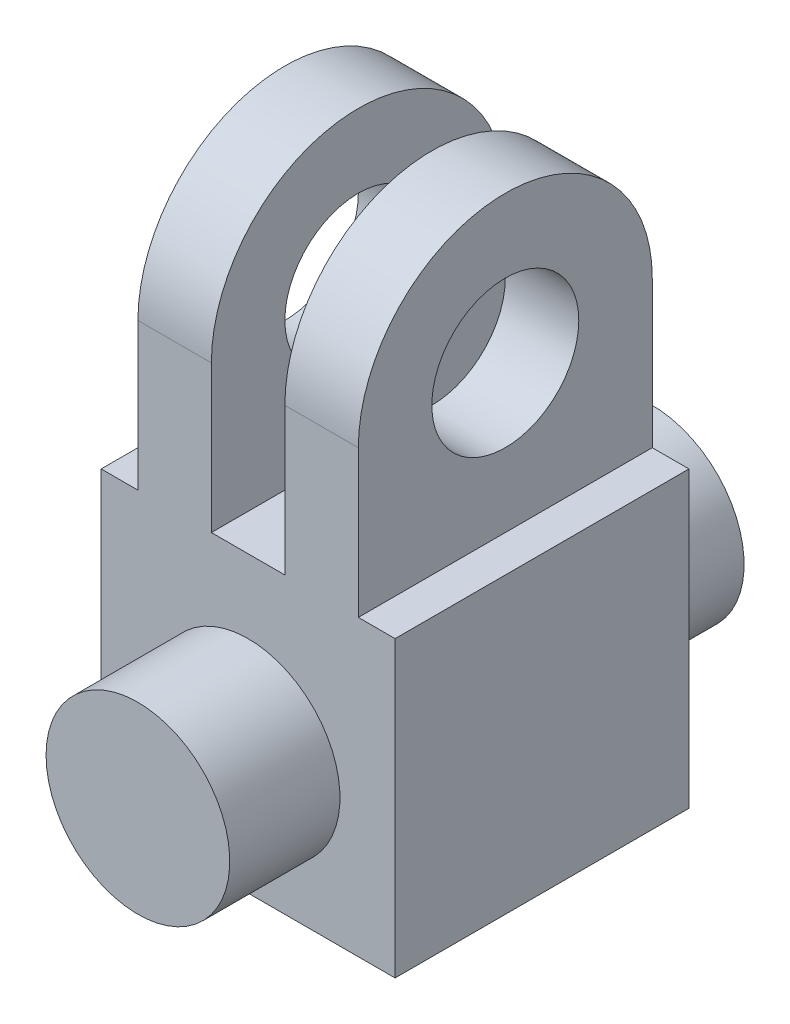
ISO-10303-21;
HEADER;
FILE_DESCRIPTION(('STEP AP214'),'2;1');
FILE_NAME('part.step','',(''),(''),'','','');
FILE_SCHEMA(('AUTOMOTIVE_DESIGN { 1 0 10303 214 1 1 1 1 }'));
ENDSEC;
DATA;
#1=APPLICATION_CONTEXT('core data for automotive mechanical design processes');
#2=APPLICATION_PROTOCOL_DEFINITION('international standard','automotive_design',2000,#1);
#3=PRODUCT_CONTEXT('',#1,'mechanical');
#4=PRODUCT('Part','Part','',(#3));
#5=PRODUCT_RELATED_PRODUCT_CATEGORY('part','',(#4));
#6=PRODUCT_DEFINITION_FORMATION('','',#4);
#7=PRODUCT_DEFINITION_CONTEXT('part definition',#1,'design');
#8=PRODUCT_DEFINITION('design','',#6,#7);
#9=PRODUCT_DEFINITION_SHAPE('','',#8);
#10=(LENGTH_UNIT() NAMED_UNIT(*) SI_UNIT(.MILLI.,.METRE.));
#11=(NAMED_UNIT(*) PLANE_ANGLE_UNIT() SI_UNIT($,.RADIAN.));
#12=(NAMED_UNIT(*) SI_UNIT($,.STERADIAN.) SOLID_ANGLE_UNIT());
#13=UNCERTAINTY_MEASURE_WITH_UNIT(LENGTH_MEASURE(1.E-05),#10,'distance_accuracy_value','');
#14=(GEOMETRIC_REPRESENTATION_CONTEXT(3) GLOBAL_UNCERTAINTY_ASSIGNED_CONTEXT((#13)) GLOBAL_UNIT_ASSIGNED_CONTEXT((#10,
#11,#12)) REPRESENTATION_CONTEXT('',''));
#15=CARTESIAN_POINT('',(0.,0.,0.));
#16=DIRECTION('',(0.,0.,1.));
#17=DIRECTION('',(1.,0.,0.));
#18=AXIS2_PLACEMENT_3D('',#15,#16,#17);
#19=CARTESIAN_POINT('',(70.,80.,0.));
#20=DIRECTION('',(-1.,0.,0.));
#21=DIRECTION('',(0.,0.,1.));
#22=AXIS2_PLACEMENT_3D('',#19,#20,#21);
#23=PLANE('',#22);
#24=CARTESIAN_POINT('',(70.,120.,40.));
#25=DIRECTION('',(1.,0.,0.));
#26=DIRECTION('',(0.,0.,-1.));
#27=AXIS2_PLACEMENT_3D('',#24,#25,#26);
#28=CIRCLE('',#27,20.);
#29=CARTESIAN_POINT('',(70.,120.,20.));
#30=VERTEX_POINT('',#29);
#31=EDGE_CURVE('E223',#30,#30,#28,.T.);
#32=ORIENTED_EDGE('',*,*,#31,.F.);
#33=EDGE_LOOP('',(#32));
#34=FACE_BOUND('',#33,.T.);
#35=DIRECTION('',(0.,1.,0.));
#36=VECTOR('',#35,1.);
#37=CARTESIAN_POINT('',(70.,80.,0.));
#38=LINE('',#37,#36);
#39=CARTESIAN_POINT('',(70.,80.,0.));
#40=VERTEX_POINT('',#39);
#41=CARTESIAN_POINT('',(70.,120.,0.));
#42=VERTEX_POINT('',#41);
#43=EDGE_CURVE('E174',#40,#42,#38,.T.);
#44=ORIENTED_EDGE('',*,*,#43,.T.);
#45=CARTESIAN_POINT('',(70.,120.,40.));
#46=DIRECTION('',(1.,0.,0.));
#47=DIRECTION('',(0.,0.,-1.));
#48=AXIS2_PLACEMENT_3D('',#45,#46,#47);
#49=CIRCLE('',#48,40.);
#50=CARTESIAN_POINT('',(70.,120.,80.));
#51=VERTEX_POINT('',#50);
#52=EDGE_CURVE('E157',#42,#51,#49,.T.);
#53=ORIENTED_EDGE('',*,*,#52,.T.);
#54=DIRECTION('',(0.,1.,0.));
#55=VECTOR('',#54,1.);
#56=CARTESIAN_POINT('',(70.,80.,80.));
#57=LINE('',#56,#55);
#58=CARTESIAN_POINT('',(70.,80.,80.));
#59=VERTEX_POINT('',#58);
#60=EDGE_CURVE('E183',#59,#51,#57,.T.);
#61=ORIENTED_EDGE('',*,*,#60,.F.);
#62=DIRECTION('',(0.,0.,1.));
#63=VECTOR('',#62,1.);
#64=CARTESIAN_POINT('',(70.,80.,0.));
#65=LINE('',#64,#63);
#66=EDGE_CURVE('E180',#40,#59,#65,.T.);
#67=ORIENTED_EDGE('',*,*,#66,.F.);
#68=EDGE_LOOP('',(#44,#53,#61,#67));
#69=FACE_BOUND('',#68,.T.);
#70=ADVANCED_FACE('F63',(#34,#69),#23,.F.);
#71=CARTESIAN_POINT('',(10.,80.,0.));
#72=DIRECTION('',(1.,0.,0.));
#73=DIRECTION('',(0.,0.,-1.));
#74=AXIS2_PLACEMENT_3D('',#71,#72,#73);
#75=PLANE('',#74);
#76=CARTESIAN_POINT('',(10.,120.,40.));
#77=DIRECTION('',(1.,0.,0.));
#78=DIRECTION('',(0.,0.,-1.));
#79=AXIS2_PLACEMENT_3D('',#76,#77,#78);
#80=CIRCLE('',#79,20.);
#81=CARTESIAN_POINT('',(10.,120.,20.));
#82=VERTEX_POINT('',#81);
#83=EDGE_CURVE('E167',#82,#82,#80,.T.);
#84=ORIENTED_EDGE('',*,*,#83,.T.);
#85=EDGE_LOOP('',(#84));
#86=FACE_BOUND('',#85,.T.);
#87=CARTESIAN_POINT('',(10.,120.,40.));
#88=DIRECTION('',(1.,0.,0.));
#89=DIRECTION('',(0.,0.,-1.));
#90=AXIS2_PLACEMENT_3D('',#87,#88,#89);
#91=CIRCLE('',#90,40.);
#92=CARTESIAN_POINT('',(10.,120.,0.));
#93=VERTEX_POINT('',#92);
#94=CARTESIAN_POINT('',(10.,120.,80.));
#95=VERTEX_POINT('',#94);
#96=EDGE_CURVE('E248',#93,#95,#91,.T.);
#97=ORIENTED_EDGE('',*,*,#96,.F.);
#98=DIRECTION('',(0.,1.,0.));
#99=VECTOR('',#98,1.);
#100=CARTESIAN_POINT('',(10.,80.,0.));
#101=LINE('',#100,#99);
#102=CARTESIAN_POINT('',(10.,80.,0.));
#103=VERTEX_POINT('',#102);
#104=EDGE_CURVE('E196',#103,#93,#101,.T.);
#105=ORIENTED_EDGE('',*,*,#104,.F.);
#106=DIRECTION('',(0.,0.,-1.));
#107=VECTOR('',#106,1.);
#108=CARTESIAN_POINT('',(10.,80.,0.));
#109=LINE('',#108,#107);
#110=CARTESIAN_POINT('',(10.,80.,80.));
#111=VERTEX_POINT('',#110);
#112=EDGE_CURVE('E288',#111,#103,#109,.T.);
#113=ORIENTED_EDGE('',*,*,#112,.F.);
#114=DIRECTION('',(0.,1.,0.));
#115=VECTOR('',#114,1.);
#116=CARTESIAN_POINT('',(10.,80.,80.));
#117=LINE('',#116,#115);
#118=EDGE_CURVE('E295',#111,#95,#117,.T.);
#119=ORIENTED_EDGE('',*,*,#118,.T.);
#120=EDGE_LOOP('',(#97,#105,#113,#119));
#121=FACE_BOUND('',#120,.T.);
#122=ADVANCED_FACE('F332',(#86,#121),#75,.F.);
#123=CARTESIAN_POINT('',(30.,80.,0.));
#124=DIRECTION('',(-1.,0.,0.));
#125=DIRECTION('',(0.,0.,1.));
#126=AXIS2_PLACEMENT_3D('',#123,#124,#125);
#127=PLANE('',#126);
#128=CARTESIAN_POINT('',(30.,120.,40.));
#129=DIRECTION('',(-1.,0.,0.));
#130=DIRECTION('',(0.,0.,1.));
#131=AXIS2_PLACEMENT_3D('',#128,#129,#130);
#132=CIRCLE('',#131,20.);
#133=CARTESIAN_POINT('',(30.,120.,60.));
#134=VERTEX_POINT('',#133);
#135=EDGE_CURVE('E222',#134,#134,#132,.T.);
#136=ORIENTED_EDGE('',*,*,#135,.T.);
#137=EDGE_LOOP('',(#136));
#138=FACE_BOUND('',#137,.T.);
#139=DIRECTION('',(0.,1.,0.));
#140=VECTOR('',#139,1.);
#141=CARTESIAN_POINT('',(30.,80.,0.));
#142=LINE('',#141,#140);
#143=CARTESIAN_POINT('',(30.,80.,0.));
#144=VERTEX_POINT('',#143);
#145=CARTESIAN_POINT('',(30.,120.,0.));
#146=VERTEX_POINT('',#145);
#147=EDGE_CURVE('E268',#144,#146,#142,.T.);
#148=ORIENTED_EDGE('',*,*,#147,.T.);
#149=CARTESIAN_POINT('',(30.,120.,40.));
#150=DIRECTION('',(-1.,0.,0.));
#151=DIRECTION('',(0.,0.,1.));
#152=AXIS2_PLACEMENT_3D('',#149,#150,#151);
#153=CIRCLE('',#152,40.);
#154=CARTESIAN_POINT('',(30.,120.,80.));
#155=VERTEX_POINT('',#154);
#156=EDGE_CURVE('E245',#155,#146,#153,.T.);
#157=ORIENTED_EDGE('',*,*,#156,.F.);
#158=DIRECTION('',(0.,1.,0.));
#159=VECTOR('',#158,1.);
#160=CARTESIAN_POINT('',(30.,80.,80.));
#161=LINE('',#160,#159);
#162=CARTESIAN_POINT('',(30.,80.,80.));
#163=VERTEX_POINT('',#162);
#164=EDGE_CURVE('E267',#163,#155,#161,.T.);
#165=ORIENTED_EDGE('',*,*,#164,.F.);
#166=DIRECTION('',(0.,0.,1.));
#167=VECTOR('',#166,1.);
#168=CARTESIAN_POINT('',(30.,80.,0.));
#169=LINE('',#168,#167);
#170=EDGE_CURVE('E251',#144,#163,#169,.T.);
#171=ORIENTED_EDGE('',*,*,#170,.F.);
#172=EDGE_LOOP('',(#148,#157,#165,#171));
#173=FACE_BOUND('',#172,.T.);
#174=ADVANCED_FACE('F335',(#138,#173),#127,.F.);
#175=CARTESIAN_POINT('',(50.,80.,0.));
#176=DIRECTION('',(1.,0.,0.));
#177=DIRECTION('',(0.,0.,-1.));
#178=AXIS2_PLACEMENT_3D('',#175,#176,#177);
#179=PLANE('',#178);
#180=CARTESIAN_POINT('',(50.,120.,40.));
#181=DIRECTION('',(1.,0.,0.));
#182=DIRECTION('',(0.,0.,-1.));
#183=AXIS2_PLACEMENT_3D('',#180,#181,#182);
#184=CIRCLE('',#183,20.);
#185=CARTESIAN_POINT('',(50.,120.,20.));
#186=VERTEX_POINT('',#185);
#187=EDGE_CURVE('E219',#186,#186,#184,.T.);
#188=ORIENTED_EDGE('',*,*,#187,.T.);
#189=EDGE_LOOP('',(#188));
#190=FACE_BOUND('',#189,.T.);
#191=CARTESIAN_POINT('',(50.,120.,40.));
#192=DIRECTION('',(1.,0.,0.));
#193=DIRECTION('',(0.,0.,-1.));
#194=AXIS2_PLACEMENT_3D('',#191,#192,#193);
#195=CIRCLE('',#194,40.);
#196=CARTESIAN_POINT('',(50.,120.,0.));
#197=VERTEX_POINT('',#196);
#198=CARTESIAN_POINT('',(50.,120.,80.));
#199=VERTEX_POINT('',#198);
#200=EDGE_CURVE('E178',#197,#199,#195,.T.);
#201=ORIENTED_EDGE('',*,*,#200,.F.);
#202=DIRECTION('',(0.,1.,0.));
#203=VECTOR('',#202,1.);
#204=CARTESIAN_POINT('',(50.,80.,0.));
#205=LINE('',#204,#203);
#206=CARTESIAN_POINT('',(50.,80.,0.));
#207=VERTEX_POINT('',#206);
#208=EDGE_CURVE('E176',#207,#197,#205,.T.);
#209=ORIENTED_EDGE('',*,*,#208,.F.);
#210=DIRECTION('',(0.,0.,-1.));
#211=VECTOR('',#210,1.);
#212=CARTESIAN_POINT('',(50.,80.,0.));
#213=LINE('',#212,#211);
#214=CARTESIAN_POINT('',(50.,80.,80.));
#215=VERTEX_POINT('',#214);
#216=EDGE_CURVE('E259',#215,#207,#213,.T.);
#217=ORIENTED_EDGE('',*,*,#216,.F.);
#218=DIRECTION('',(0.,1.,0.));
#219=VECTOR('',#218,1.);
#220=CARTESIAN_POINT('',(50.,80.,80.));
#221=LINE('',#220,#219);
#222=EDGE_CURVE('E275',#215,#199,#221,.T.);
#223=ORIENTED_EDGE('',*,*,#222,.T.);
#224=EDGE_LOOP('',(#201,#209,#217,#223));
#225=FACE_BOUND('',#224,.T.);
#226=ADVANCED_FACE('F341',(#190,#225),#179,.F.);
#227=CARTESIAN_POINT('',(0.,160.,80.));
#228=DIRECTION('',(0.,0.,-1.));
#229=DIRECTION('',(-1.,0.,0.));
#230=AXIS2_PLACEMENT_3D('',#227,#228,#229);
#231=PLANE('',#230);
#232=CARTESIAN_POINT('',(40.,35.,80.));
#233=DIRECTION('',(0.,0.,-1.));
#234=DIRECTION('',(-1.,0.,0.));
#235=AXIS2_PLACEMENT_3D('',#232,#233,#234);
#236=CIRCLE('',#235,25.);
#237=CARTESIAN_POINT('',(15.,35.,80.));
#238=VERTEX_POINT('',#237);
#239=EDGE_CURVE('E231',#238,#238,#236,.T.);
#240=ORIENTED_EDGE('',*,*,#239,.T.);
#241=EDGE_LOOP('',(#240));
#242=FACE_BOUND('',#241,.T.);
#243=DIRECTION('',(1.,0.,0.));
#244=VECTOR('',#243,1.);
#245=CARTESIAN_POINT('',(-9.99999999999997,120.,80.));
#246=LINE('',#245,#244);
#247=EDGE_CURVE('E81',#95,#155,#246,.T.);
#248=ORIENTED_EDGE('',*,*,#247,.F.);
#249=ORIENTED_EDGE('',*,*,#118,.F.);
#250=DIRECTION('',(1.,0.,0.));
#251=VECTOR('',#250,1.);
#252=CARTESIAN_POINT('',(0.,80.,80.));
#253=LINE('',#252,#251);
#254=CARTESIAN_POINT('',(0.,80.,80.));
#255=VERTEX_POINT('',#254);
#256=EDGE_CURVE('E284',#255,#111,#253,.T.);
#257=ORIENTED_EDGE('',*,*,#256,.F.);
#258=DIRECTION('',(0.,-1.,0.));
#259=VECTOR('',#258,1.);
#260=CARTESIAN_POINT('',(0.,160.,80.));
#261=LINE('',#260,#259);
#262=CARTESIAN_POINT('',(0.,0.,80.));
#263=VERTEX_POINT('',#262);
#264=EDGE_CURVE('E215',#255,#263,#261,.T.);
#265=ORIENTED_EDGE('',*,*,#264,.T.);
#266=DIRECTION('',(1.,0.,0.));
#267=VECTOR('',#266,1.);
#268=CARTESIAN_POINT('',(0.,0.,80.));
#269=LINE('',#268,#267);
#270=CARTESIAN_POINT('',(80.,0.,80.));
#271=VERTEX_POINT('',#270);
#272=EDGE_CURVE('E195',#263,#271,#269,.T.);
#273=ORIENTED_EDGE('',*,*,#272,.T.);
#274=DIRECTION('',(0.,-1.,0.));
#275=VECTOR('',#274,1.);
#276=CARTESIAN_POINT('',(80.,160.,80.));
#277=LINE('',#276,#275);
#278=CARTESIAN_POINT('',(80.,80.,80.));
#279=VERTEX_POINT('',#278);
#280=EDGE_CURVE('E212',#279,#271,#277,.T.);
#281=ORIENTED_EDGE('',*,*,#280,.F.);
#282=DIRECTION('',(1.,0.,0.));
#283=VECTOR('',#282,1.);
#284=CARTESIAN_POINT('',(80.,80.,80.));
#285=LINE('',#284,#283);
#286=EDGE_CURVE('E184',#59,#279,#285,.T.);
#287=ORIENTED_EDGE('',*,*,#286,.F.);
#288=ORIENTED_EDGE('',*,*,#60,.T.);
#289=EDGE_CURVE('E162',#199,#51,#246,.T.);
#290=ORIENTED_EDGE('',*,*,#289,.F.);
#291=ORIENTED_EDGE('',*,*,#222,.F.);
#292=DIRECTION('',(1.,0.,0.));
#293=VECTOR('',#292,1.);
#294=CARTESIAN_POINT('',(30.,80.,80.));
#295=LINE('',#294,#293);
#296=EDGE_CURVE('E255',#163,#215,#295,.T.);
#297=ORIENTED_EDGE('',*,*,#296,.F.);
#298=ORIENTED_EDGE('',*,*,#164,.T.);
#299=EDGE_LOOP('',(#248,#249,#257,#265,#273,#281,#287,#288,#290,#291,#297,#298));
#300=FACE_BOUND('',#299,.T.);
#301=ADVANCED_FACE('F313',(#242,#300),#231,.F.);
#302=CARTESIAN_POINT('',(0.,160.,0.));
#303=DIRECTION('',(1.,0.,0.));
#304=DIRECTION('',(0.,0.,-1.));
#305=AXIS2_PLACEMENT_3D('',#302,#303,#304);
#306=PLANE('',#305);
#307=DIRECTION('',(0.,0.,1.));
#308=VECTOR('',#307,1.);
#309=CARTESIAN_POINT('',(0.,80.,0.));
#310=LINE('',#309,#308);
#311=CARTESIAN_POINT('',(0.,80.,0.));
#312=VERTEX_POINT('',#311);
#313=EDGE_CURVE('E188',#312,#255,#310,.T.);
#314=ORIENTED_EDGE('',*,*,#313,.F.);
#315=DIRECTION('',(0.,-1.,0.));
#316=VECTOR('',#315,1.);
#317=CARTESIAN_POINT('',(0.,160.,0.));
#318=LINE('',#317,#316);
#319=CARTESIAN_POINT('',(0.,0.,0.));
#320=VERTEX_POINT('',#319);
#321=EDGE_CURVE('E89',#312,#320,#318,.T.);
#322=ORIENTED_EDGE('',*,*,#321,.T.);
#323=DIRECTION('',(0.,0.,1.));
#324=VECTOR('',#323,1.);
#325=CARTESIAN_POINT('',(0.,0.,0.));
#326=LINE('',#325,#324);
#327=EDGE_CURVE('E192',#320,#263,#326,.T.);
#328=ORIENTED_EDGE('',*,*,#327,.T.);
#329=ORIENTED_EDGE('',*,*,#264,.F.);
#330=EDGE_LOOP('',(#314,#322,#328,#329));
#331=FACE_BOUND('',#330,.T.);
#332=ADVANCED_FACE('F65',(#331),#306,.F.);
#333=CARTESIAN_POINT('',(80.,160.,0.));
#334=DIRECTION('',(-1.,0.,0.));
#335=DIRECTION('',(0.,0.,1.));
#336=AXIS2_PLACEMENT_3D('',#333,#334,#335);
#337=PLANE('',#336);
#338=DIRECTION('',(0.,-1.,0.));
#339=VECTOR('',#338,1.);
#340=CARTESIAN_POINT('',(80.,160.,0.));
#341=LINE('',#340,#339);
#342=CARTESIAN_POINT('',(80.,80.,0.));
#343=VERTEX_POINT('',#342);
#344=CARTESIAN_POINT('',(80.,0.,0.));
#345=VERTEX_POINT('',#344);
#346=EDGE_CURVE('E209',#343,#345,#341,.T.);
#347=ORIENTED_EDGE('',*,*,#346,.F.);
#348=DIRECTION('',(0.,0.,-1.));
#349=VECTOR('',#348,1.);
#350=CARTESIAN_POINT('',(80.,80.,0.));
#351=LINE('',#350,#349);
#352=EDGE_CURVE('E272',#279,#343,#351,.T.);
#353=ORIENTED_EDGE('',*,*,#352,.F.);
#354=ORIENTED_EDGE('',*,*,#280,.T.);
#355=DIRECTION('',(0.,0.,-1.));
#356=VECTOR('',#355,1.);
#357=CARTESIAN_POINT('',(80.,0.,0.));
#358=LINE('',#357,#356);
#359=EDGE_CURVE('E200',#271,#345,#358,.T.);
#360=ORIENTED_EDGE('',*,*,#359,.T.);
#361=EDGE_LOOP('',(#347,#353,#354,#360));
#362=FACE_BOUND('',#361,.T.);
#363=ADVANCED_FACE('F318',(#362),#337,.F.);
#364=CARTESIAN_POINT('',(0.,160.,0.));
#365=DIRECTION('',(0.,0.,1.));
#366=DIRECTION('',(1.,0.,0.));
#367=AXIS2_PLACEMENT_3D('',#364,#365,#366);
#368=PLANE('',#367);
#369=CARTESIAN_POINT('',(40.,35.,0.));
#370=DIRECTION('',(0.,0.,1.));
#371=DIRECTION('',(1.,0.,0.));
#372=AXIS2_PLACEMENT_3D('',#369,#370,#371);
#373=CIRCLE('',#372,25.);
#374=CARTESIAN_POINT('',(65.,35.,0.));
#375=VERTEX_POINT('',#374);
#376=EDGE_CURVE('E67',#375,#375,#373,.T.);
#377=ORIENTED_EDGE('',*,*,#376,.T.);
#378=EDGE_LOOP('',(#377));
#379=FACE_BOUND('',#378,.T.);
#380=ORIENTED_EDGE('',*,*,#104,.T.);
#381=DIRECTION('',(1.,0.,0.));
#382=VECTOR('',#381,1.);
#383=CARTESIAN_POINT('',(-9.99999999999998,120.,0.));
#384=LINE('',#383,#382);
#385=EDGE_CURVE('E12',#93,#146,#384,.T.);
#386=ORIENTED_EDGE('',*,*,#385,.T.);
#387=ORIENTED_EDGE('',*,*,#147,.F.);
#388=DIRECTION('',(-1.,0.,0.));
#389=VECTOR('',#388,1.);
#390=CARTESIAN_POINT('',(30.,80.,0.));
#391=LINE('',#390,#389);
#392=EDGE_CURVE('E263',#207,#144,#391,.T.);
#393=ORIENTED_EDGE('',*,*,#392,.F.);
#394=ORIENTED_EDGE('',*,*,#208,.T.);
#395=EDGE_CURVE('E73',#197,#42,#384,.T.);
#396=ORIENTED_EDGE('',*,*,#395,.T.);
#397=ORIENTED_EDGE('',*,*,#43,.F.);
#398=DIRECTION('',(-1.,0.,0.));
#399=VECTOR('',#398,1.);
#400=CARTESIAN_POINT('',(80.,80.,0.));
#401=LINE('',#400,#399);
#402=EDGE_CURVE('E303',#343,#40,#401,.T.);
#403=ORIENTED_EDGE('',*,*,#402,.F.);
#404=ORIENTED_EDGE('',*,*,#346,.T.);
#405=DIRECTION('',(-1.,0.,0.));
#406=VECTOR('',#405,1.);
#407=CARTESIAN_POINT('',(0.,0.,0.));
#408=LINE('',#407,#406);
#409=EDGE_CURVE('E204',#345,#320,#408,.T.);
#410=ORIENTED_EDGE('',*,*,#409,.T.);
#411=ORIENTED_EDGE('',*,*,#321,.F.);
#412=DIRECTION('',(-1.,0.,0.));
#413=VECTOR('',#412,1.);
#414=CARTESIAN_POINT('',(0.,80.,0.));
#415=LINE('',#414,#413);
#416=EDGE_CURVE('E292',#103,#312,#415,.T.);
#417=ORIENTED_EDGE('',*,*,#416,.F.);
#418=EDGE_LOOP('',(#380,#386,#387,#393,#394,#396,#397,#403,#404,#410,#411,#417));
#419=FACE_BOUND('',#418,.T.);
#420=ADVANCED_FACE('F172',(#379,#419),#368,.F.);
#421=CARTESIAN_POINT('',(0.,0.,0.));
#422=DIRECTION('',(0.,1.,0.));
#423=DIRECTION('',(0.,0.,1.));
#424=AXIS2_PLACEMENT_3D('',#421,#422,#423);
#425=PLANE('',#424);
#426=ORIENTED_EDGE('',*,*,#327,.F.);
#427=ORIENTED_EDGE('',*,*,#409,.F.);
#428=ORIENTED_EDGE('',*,*,#359,.F.);
#429=ORIENTED_EDGE('',*,*,#272,.F.);
#430=EDGE_LOOP('',(#426,#427,#428,#429));
#431=FACE_BOUND('',#430,.T.);
#432=ADVANCED_FACE('F323',(#431),#425,.F.);
#433=CARTESIAN_POINT('',(0.,80.,0.));
#434=DIRECTION('',(0.,-1.,0.));
#435=DIRECTION('',(0.,0.,-1.));
#436=AXIS2_PLACEMENT_3D('',#433,#434,#435);
#437=PLANE('',#436);
#438=ORIENTED_EDGE('',*,*,#352,.T.);
#439=ORIENTED_EDGE('',*,*,#402,.T.);
#440=ORIENTED_EDGE('',*,*,#66,.T.);
#441=ORIENTED_EDGE('',*,*,#286,.T.);
#442=EDGE_LOOP('',(#438,#439,#440,#441));
#443=FACE_BOUND('',#442,.T.);
#444=ADVANCED_FACE('F309',(#443),#437,.F.);
#445=CARTESIAN_POINT('',(0.,80.,0.));
#446=DIRECTION('',(0.,1.,0.));
#447=DIRECTION('',(0.,0.,1.));
#448=AXIS2_PLACEMENT_3D('',#445,#446,#447);
#449=PLANE('',#448);
#450=ORIENTED_EDGE('',*,*,#313,.T.);
#451=ORIENTED_EDGE('',*,*,#256,.T.);
#452=ORIENTED_EDGE('',*,*,#112,.T.);
#453=ORIENTED_EDGE('',*,*,#416,.T.);
#454=EDGE_LOOP('',(#450,#451,#452,#453));
#455=FACE_BOUND('',#454,.T.);
#456=ADVANCED_FACE('F328',(#455),#449,.T.);
#457=CARTESIAN_POINT('',(0.,80.,0.));
#458=DIRECTION('',(0.,1.,0.));
#459=DIRECTION('',(0.,0.,1.));
#460=AXIS2_PLACEMENT_3D('',#457,#458,#459);
#461=PLANE('',#460);
#462=ORIENTED_EDGE('',*,*,#170,.T.);
#463=ORIENTED_EDGE('',*,*,#296,.T.);
#464=ORIENTED_EDGE('',*,*,#216,.T.);
#465=ORIENTED_EDGE('',*,*,#392,.T.);
#466=EDGE_LOOP('',(#462,#463,#464,#465));
#467=FACE_BOUND('',#466,.T.);
#468=ADVANCED_FACE('F339',(#467),#461,.T.);
#469=CARTESIAN_POINT('',(-9.99999999999998,120.,40.));
#470=DIRECTION('',(1.,0.,0.));
#471=DIRECTION('',(0.,0.,-1.));
#472=AXIS2_PLACEMENT_3D('',#469,#470,#471);
#473=CYLINDRICAL_SURFACE('',#472,40.);
#474=ORIENTED_EDGE('',*,*,#200,.T.);
#475=ORIENTED_EDGE('',*,*,#289,.T.);
#476=ORIENTED_EDGE('',*,*,#52,.F.);
#477=ORIENTED_EDGE('',*,*,#395,.F.);
#478=EDGE_LOOP('',(#474,#475,#476,#477));
#479=FACE_BOUND('',#478,.T.);
#480=ADVANCED_FACE('F159',(#479),#473,.T.);
#481=ORIENTED_EDGE('',*,*,#96,.T.);
#482=ORIENTED_EDGE('',*,*,#247,.T.);
#483=ORIENTED_EDGE('',*,*,#156,.T.);
#484=ORIENTED_EDGE('',*,*,#385,.F.);
#485=EDGE_LOOP('',(#481,#482,#483,#484));
#486=FACE_BOUND('',#485,.T.);
#487=ADVANCED_FACE('F333',(#486),#473,.T.);
#488=CARTESIAN_POINT('',(-9.99999999999998,120.,40.));
#489=DIRECTION('',(1.,0.,0.));
#490=DIRECTION('',(0.,0.,-1.));
#491=AXIS2_PLACEMENT_3D('',#488,#489,#490);
#492=CYLINDRICAL_SURFACE('',#491,20.);
#493=ORIENTED_EDGE('',*,*,#31,.T.);
#494=EDGE_LOOP('',(#493));
#495=FACE_BOUND('',#494,.T.);
#496=ORIENTED_EDGE('',*,*,#187,.F.);
#497=EDGE_LOOP('',(#496));
#498=FACE_BOUND('',#497,.T.);
#499=ADVANCED_FACE('F440',(#495,#498),#492,.F.);
#500=ORIENTED_EDGE('',*,*,#135,.F.);
#501=EDGE_LOOP('',(#500));
#502=FACE_BOUND('',#501,.T.);
#503=ORIENTED_EDGE('',*,*,#83,.F.);
#504=EDGE_LOOP('',(#503));
#505=FACE_BOUND('',#504,.T.);
#506=ADVANCED_FACE('F386',(#502,#505),#492,.F.);
#507=CARTESIAN_POINT('',(40.,35.,-30.));
#508=DIRECTION('',(0.,0.,-1.));
#509=DIRECTION('',(-1.,0.,0.));
#510=AXIS2_PLACEMENT_3D('',#507,#508,#509);
#511=PLANE('',#510);
#512=CARTESIAN_POINT('',(40.,35.,-30.));
#513=DIRECTION('',(0.,0.,-1.));
#514=DIRECTION('',(-1.,0.,0.));
#515=AXIS2_PLACEMENT_3D('',#512,#513,#514);
#516=CIRCLE('',#515,25.);
#517=CARTESIAN_POINT('',(15.,35.,-30.));
#518=VERTEX_POINT('',#517);
#519=EDGE_CURVE('E527',#518,#518,#516,.T.);
#520=ORIENTED_EDGE('',*,*,#519,.T.);
#521=EDGE_LOOP('',(#520));
#522=FACE_BOUND('',#521,.T.);
#523=ADVANCED_FACE('F399',(#522),#511,.T.);
#524=CARTESIAN_POINT('',(40.,35.,110.));
#525=DIRECTION('',(0.,0.,-1.));
#526=DIRECTION('',(-1.,0.,0.));
#527=AXIS2_PLACEMENT_3D('',#524,#525,#526);
#528=CYLINDRICAL_SURFACE('',#527,25.);
#529=ORIENTED_EDGE('',*,*,#519,.F.);
#530=EDGE_LOOP('',(#529));
#531=FACE_BOUND('',#530,.T.);
#532=ORIENTED_EDGE('',*,*,#376,.F.);
#533=EDGE_LOOP('',(#532));
#534=FACE_BOUND('',#533,.T.);
#535=ADVANCED_FACE('F404',(#531,#534),#528,.T.);
#536=CARTESIAN_POINT('',(40.,35.,110.));
#537=DIRECTION('',(0.,0.,-1.));
#538=DIRECTION('',(-1.,0.,0.));
#539=AXIS2_PLACEMENT_3D('',#536,#537,#538);
#540=CIRCLE('',#539,25.);
#541=CARTESIAN_POINT('',(15.,35.,110.));
#542=VERTEX_POINT('',#541);
#543=EDGE_CURVE('E525',#542,#542,#540,.T.);
#544=ORIENTED_EDGE('',*,*,#543,.T.);
#545=EDGE_LOOP('',(#544));
#546=FACE_BOUND('',#545,.T.);
#547=ORIENTED_EDGE('',*,*,#239,.F.);
#548=EDGE_LOOP('',(#547));
#549=FACE_BOUND('',#548,.T.);
#550=ADVANCED_FACE('F414',(#546,#549),#528,.T.);
#551=CARTESIAN_POINT('',(40.,35.,110.));
#552=DIRECTION('',(0.,0.,-1.));
#553=DIRECTION('',(-1.,0.,0.));
#554=AXIS2_PLACEMENT_3D('',#551,#552,#553);
#555=PLANE('',#554);
#556=ORIENTED_EDGE('',*,*,#543,.F.);
#557=EDGE_LOOP('',(#556));
#558=FACE_BOUND('',#557,.T.);
#559=ADVANCED_FACE('F424',(#558),#555,.F.);
#560=CLOSED_SHELL('',(#70,#122,#174,#226,#301,#332,#363,#420,#432,#444,#456,#468,#480,#487,#499,
#506,#523,#535,#550,#559));
#561=MANIFOLD_SOLID_BREP('B2',#560);
#562=ADVANCED_BREP_SHAPE_REPRESENTATION('',(#18,#561),#14);
#563=SHAPE_DEFINITION_REPRESENTATION(#9,#562);
ENDSEC;
END-ISO-10303-21;
